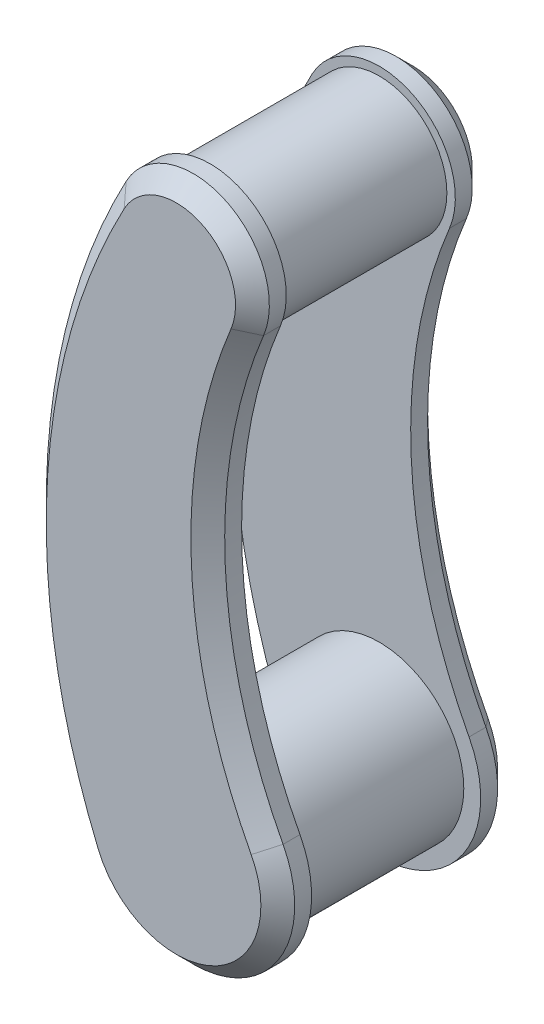
ISO-10303-21;
HEADER;
FILE_DESCRIPTION(('STEP AP214'),'2;1');
FILE_NAME('part.step','',(''),(''),'','','');
FILE_SCHEMA(('AUTOMOTIVE_DESIGN { 1 0 10303 214 1 1 1 1 }'));
ENDSEC;
DATA;
#1=APPLICATION_CONTEXT('core data for automotive mechanical design processes');
#2=APPLICATION_PROTOCOL_DEFINITION('international standard','automotive_design',2000,#1);
#3=PRODUCT_CONTEXT('',#1,'mechanical');
#4=PRODUCT('Part','Part','',(#3));
#5=PRODUCT_RELATED_PRODUCT_CATEGORY('part','',(#4));
#6=PRODUCT_DEFINITION_FORMATION('','',#4);
#7=PRODUCT_DEFINITION_CONTEXT('part definition',#1,'design');
#8=PRODUCT_DEFINITION('design','',#6,#7);
#9=PRODUCT_DEFINITION_SHAPE('','',#8);
#10=(LENGTH_UNIT() NAMED_UNIT(*) SI_UNIT(.MILLI.,.METRE.));
#11=(NAMED_UNIT(*) PLANE_ANGLE_UNIT() SI_UNIT($,.RADIAN.));
#12=(NAMED_UNIT(*) SI_UNIT($,.STERADIAN.) SOLID_ANGLE_UNIT());
#13=UNCERTAINTY_MEASURE_WITH_UNIT(LENGTH_MEASURE(1.E-05),#10,'distance_accuracy_value','');
#14=(GEOMETRIC_REPRESENTATION_CONTEXT(3) GLOBAL_UNCERTAINTY_ASSIGNED_CONTEXT((#13)) GLOBAL_UNIT_ASSIGNED_CONTEXT((#10,
#11,#12)) REPRESENTATION_CONTEXT('',''));
#15=CARTESIAN_POINT('',(0.,0.,0.));
#16=DIRECTION('',(0.,0.,1.));
#17=DIRECTION('',(1.,0.,0.));
#18=AXIS2_PLACEMENT_3D('',#15,#16,#17);
#19=CARTESIAN_POINT('',(156.53323079701,-8.68749999999996,35.));
#20=DIRECTION('',(0.,0.,-1.));
#21=DIRECTION('',(-1.,0.,0.));
#22=AXIS2_PLACEMENT_3D('',#19,#20,#21);
#23=CYLINDRICAL_SURFACE('',#22,200.);
#24=DIRECTION('',(0.,0.,-1.));
#25=VECTOR('',#24,1.);
#26=CARTESIAN_POINT('',(-27.6235113171194,-86.7022058823529,35.));
#27=LINE('',#26,#25);
#28=CARTESIAN_POINT('',(-27.6235113171194,-86.7022058823529,30.));
#29=VERTEX_POINT('',#28);
#30=CARTESIAN_POINT('',(-27.6235113171194,-86.7022058823529,25.));
#31=VERTEX_POINT('',#30);
#32=EDGE_CURVE('E213',#29,#31,#27,.T.);
#33=ORIENTED_EDGE('',*,*,#32,.F.);
#34=CARTESIAN_POINT('',(156.53323079701,-8.68749999999996,30.));
#35=DIRECTION('',(0.,0.,1.));
#36=DIRECTION('',(1.,0.,0.));
#37=AXIS2_PLACEMENT_3D('',#34,#35,#36);
#38=CIRCLE('',#37,200.);
#39=CARTESIAN_POINT('',(-19.8422405235647,85.6082746478873,30.));
#40=VERTEX_POINT('',#39);
#41=EDGE_CURVE('E227',#29,#40,#38,.F.);
#42=ORIENTED_EDGE('',*,*,#41,.T.);
#43=DIRECTION('',(0.,0.,-1.));
#44=VECTOR('',#43,1.);
#45=CARTESIAN_POINT('',(-19.8422405235647,85.6082746478873,35.));
#46=LINE('',#45,#44);
#47=CARTESIAN_POINT('',(-19.8422405235647,85.6082746478873,25.));
#48=VERTEX_POINT('',#47);
#49=EDGE_CURVE('E207',#40,#48,#46,.T.);
#50=ORIENTED_EDGE('',*,*,#49,.T.);
#51=CARTESIAN_POINT('',(156.53323079701,-8.68749999999996,25.));
#52=DIRECTION('',(0.,0.,1.));
#53=DIRECTION('',(1.,0.,0.));
#54=AXIS2_PLACEMENT_3D('',#51,#52,#53);
#55=CIRCLE('',#54,200.);
#56=EDGE_CURVE('E194',#48,#31,#55,.T.);
#57=ORIENTED_EDGE('',*,*,#56,.T.);
#58=EDGE_LOOP('',(#33,#42,#50,#57));
#59=FACE_BOUND('',#58,.T.);
#60=ADVANCED_FACE('F36',(#59),#23,.T.);
#61=CARTESIAN_POINT('',(0.,-75.,35.));
#62=DIRECTION('',(0.,0.,-1.));
#63=DIRECTION('',(-1.,0.,0.));
#64=AXIS2_PLACEMENT_3D('',#61,#62,#63);
#65=CYLINDRICAL_SURFACE('',#64,30.);
#66=DIRECTION('',(0.,0.,-1.));
#67=VECTOR('',#66,1.);
#68=CARTESIAN_POINT('',(26.549463712804,-61.0312499999999,35.));
#69=LINE('',#68,#67);
#70=CARTESIAN_POINT('',(26.549463712804,-61.0312499999999,30.));
#71=VERTEX_POINT('',#70);
#72=CARTESIAN_POINT('',(26.549463712804,-61.0312499999999,25.));
#73=VERTEX_POINT('',#72);
#74=EDGE_CURVE('E211',#71,#73,#69,.T.);
#75=ORIENTED_EDGE('',*,*,#74,.F.);
#76=CARTESIAN_POINT('',(0.,-75.,30.));
#77=DIRECTION('',(0.,0.,1.));
#78=DIRECTION('',(1.,0.,0.));
#79=AXIS2_PLACEMENT_3D('',#76,#77,#78);
#80=CIRCLE('',#79,30.);
#81=EDGE_CURVE('E59',#71,#29,#80,.F.);
#82=ORIENTED_EDGE('',*,*,#81,.T.);
#83=ORIENTED_EDGE('',*,*,#32,.T.);
#84=CARTESIAN_POINT('',(0.,-75.,25.));
#85=DIRECTION('',(0.,0.,1.));
#86=DIRECTION('',(1.,0.,0.));
#87=AXIS2_PLACEMENT_3D('',#84,#85,#86);
#88=CIRCLE('',#87,30.);
#89=EDGE_CURVE('E197',#31,#73,#88,.T.);
#90=ORIENTED_EDGE('',*,*,#89,.T.);
#91=EDGE_LOOP('',(#75,#82,#83,#90));
#92=FACE_BOUND('',#91,.T.);
#93=ADVANCED_FACE('F262',(#92),#65,.T.);
#94=CARTESIAN_POINT('',(159.296782276824,8.81250000000006,35.));
#95=DIRECTION('',(0.,0.,-1.));
#96=DIRECTION('',(-1.,0.,0.));
#97=AXIS2_PLACEMENT_3D('',#94,#95,#96);
#98=CYLINDRICAL_SURFACE('',#97,150.);
#99=DIRECTION('',(0.,0.,-1.));
#100=VECTOR('',#99,1.);
#101=CARTESIAN_POINT('',(20.7778411665423,66.366847826087,35.));
#102=LINE('',#101,#100);
#103=CARTESIAN_POINT('',(20.7778411665423,66.366847826087,30.));
#104=VERTEX_POINT('',#103);
#105=CARTESIAN_POINT('',(20.7778411665423,66.366847826087,25.));
#106=VERTEX_POINT('',#105);
#107=EDGE_CURVE('E209',#104,#106,#102,.T.);
#108=ORIENTED_EDGE('',*,*,#107,.F.);
#109=CARTESIAN_POINT('',(159.296782276824,8.81250000000006,30.));
#110=DIRECTION('',(0.,0.,1.));
#111=DIRECTION('',(1.,0.,0.));
#112=AXIS2_PLACEMENT_3D('',#109,#110,#111);
#113=CIRCLE('',#112,150.);
#114=EDGE_CURVE('E52',#104,#71,#113,.T.);
#115=ORIENTED_EDGE('',*,*,#114,.T.);
#116=ORIENTED_EDGE('',*,*,#74,.T.);
#117=CARTESIAN_POINT('',(159.296782276824,8.81250000000006,25.));
#118=DIRECTION('',(0.,0.,-1.));
#119=DIRECTION('',(1.,0.,0.));
#120=AXIS2_PLACEMENT_3D('',#117,#118,#119);
#121=CIRCLE('',#120,150.);
#122=EDGE_CURVE('E201',#73,#106,#121,.T.);
#123=ORIENTED_EDGE('',*,*,#122,.T.);
#124=EDGE_LOOP('',(#108,#115,#116,#123));
#125=FACE_BOUND('',#124,.T.);
#126=ADVANCED_FACE('F261',(#125),#98,.F.);
#127=CARTESIAN_POINT('',(0.,75.,35.));
#128=DIRECTION('',(0.,0.,-1.));
#129=DIRECTION('',(-1.,0.,0.));
#130=AXIS2_PLACEMENT_3D('',#127,#128,#129);
#131=CYLINDRICAL_SURFACE('',#130,22.5);
#132=ORIENTED_EDGE('',*,*,#49,.F.);
#133=CARTESIAN_POINT('',(0.,75.,30.));
#134=DIRECTION('',(0.,0.,1.));
#135=DIRECTION('',(1.,0.,0.));
#136=AXIS2_PLACEMENT_3D('',#133,#134,#135);
#137=CIRCLE('',#136,22.5);
#138=EDGE_CURVE('E224',#40,#104,#137,.F.);
#139=ORIENTED_EDGE('',*,*,#138,.T.);
#140=ORIENTED_EDGE('',*,*,#107,.T.);
#141=CARTESIAN_POINT('',(0.,75.,25.));
#142=DIRECTION('',(0.,0.,1.));
#143=DIRECTION('',(1.,0.,0.));
#144=AXIS2_PLACEMENT_3D('',#141,#142,#143);
#145=CIRCLE('',#144,22.5);
#146=EDGE_CURVE('E204',#106,#48,#145,.T.);
#147=ORIENTED_EDGE('',*,*,#146,.T.);
#148=EDGE_LOOP('',(#132,#139,#140,#147));
#149=FACE_BOUND('',#148,.T.);
#150=ADVANCED_FACE('F260',(#149),#131,.T.);
#151=CARTESIAN_POINT('',(78.266615398505,-41.84375,35.));
#152=DIRECTION('',(0.,0.,1.));
#153=DIRECTION('',(1.,0.,0.));
#154=AXIS2_PLACEMENT_3D('',#151,#152,#153);
#155=PLANE('',#154);
#156=CARTESIAN_POINT('',(159.296782276824,8.81250000000006,35.));
#157=DIRECTION('',(0.,0.,1.));
#158=DIRECTION('',(1.,0.,0.));
#159=AXIS2_PLACEMENT_3D('',#156,#157,#158);
#160=CIRCLE('',#159,155.);
#161=CARTESIAN_POINT('',(22.1245530940034,-63.3593749999999,35.));
#162=VERTEX_POINT('',#161);
#163=CARTESIAN_POINT('',(16.1605431295329,68.2853260869565,35.));
#164=VERTEX_POINT('',#163);
#165=EDGE_CURVE('E217',#162,#164,#160,.F.);
#166=ORIENTED_EDGE('',*,*,#165,.T.);
#167=CARTESIAN_POINT('',(0.,75.,35.));
#168=DIRECTION('',(0.,0.,1.));
#169=DIRECTION('',(1.,0.,0.));
#170=AXIS2_PLACEMENT_3D('',#167,#168,#169);
#171=CIRCLE('',#170,17.5);
#172=CARTESIAN_POINT('',(-15.4328537405503,83.2508802816901,35.));
#173=VERTEX_POINT('',#172);
#174=EDGE_CURVE('E221',#164,#173,#171,.T.);
#175=ORIENTED_EDGE('',*,*,#174,.T.);
#176=CARTESIAN_POINT('',(156.53323079701,-8.68749999999996,35.));
#177=DIRECTION('',(0.,0.,1.));
#178=DIRECTION('',(1.,0.,0.));
#179=AXIS2_PLACEMENT_3D('',#176,#177,#178);
#180=CIRCLE('',#179,195.);
#181=CARTESIAN_POINT('',(-23.0195927642662,-84.7518382352941,35.));
#182=VERTEX_POINT('',#181);
#183=EDGE_CURVE('E219',#173,#182,#180,.T.);
#184=ORIENTED_EDGE('',*,*,#183,.T.);
#185=CARTESIAN_POINT('',(0.,-75.,35.));
#186=DIRECTION('',(0.,0.,1.));
#187=DIRECTION('',(1.,0.,0.));
#188=AXIS2_PLACEMENT_3D('',#185,#186,#187);
#189=CIRCLE('',#188,25.);
#190=EDGE_CURVE('E215',#182,#162,#189,.T.);
#191=ORIENTED_EDGE('',*,*,#190,.T.);
#192=EDGE_LOOP('',(#166,#175,#184,#191));
#193=FACE_BOUND('',#192,.T.);
#194=ADVANCED_FACE('F247',(#193),#155,.T.);
#195=CARTESIAN_POINT('',(78.266615398505,-41.84375,25.));
#196=DIRECTION('',(0.,0.,1.));
#197=DIRECTION('',(1.,0.,0.));
#198=AXIS2_PLACEMENT_3D('',#195,#196,#197);
#199=PLANE('',#198);
#200=CARTESIAN_POINT('',(0.,-75.,25.));
#201=DIRECTION('',(0.,0.,1.));
#202=DIRECTION('',(1.,0.,0.));
#203=AXIS2_PLACEMENT_3D('',#200,#201,#202);
#204=CIRCLE('',#203,25.);
#205=CARTESIAN_POINT('',(25.,-75.,25.));
#206=VERTEX_POINT('',#205);
#207=EDGE_CURVE('E11',#206,#206,#204,.F.);
#208=ORIENTED_EDGE('',*,*,#207,.F.);
#209=EDGE_LOOP('',(#208));
#210=FACE_BOUND('',#209,.T.);
#211=CARTESIAN_POINT('',(0.,75.,25.));
#212=DIRECTION('',(0.,0.,1.));
#213=DIRECTION('',(1.,0.,0.));
#214=AXIS2_PLACEMENT_3D('',#211,#212,#213);
#215=CIRCLE('',#214,20.);
#216=CARTESIAN_POINT('',(20.,75.,25.));
#217=VERTEX_POINT('',#216);
#218=EDGE_CURVE('E45',#217,#217,#215,.F.);
#219=ORIENTED_EDGE('',*,*,#218,.F.);
#220=EDGE_LOOP('',(#219));
#221=FACE_BOUND('',#220,.T.);
#222=ORIENTED_EDGE('',*,*,#56,.F.);
#223=ORIENTED_EDGE('',*,*,#146,.F.);
#224=ORIENTED_EDGE('',*,*,#122,.F.);
#225=ORIENTED_EDGE('',*,*,#89,.F.);
#226=EDGE_LOOP('',(#222,#223,#224,#225));
#227=FACE_BOUND('',#226,.T.);
#228=ADVANCED_FACE('F244',(#210,#221,#227),#199,.F.);
#229=CARTESIAN_POINT('',(0.,-75.,35.));
#230=DIRECTION('',(0.,0.,-1.));
#231=DIRECTION('',(-1.,0.,0.));
#232=AXIS2_PLACEMENT_3D('',#229,#230,#231);
#233=CONICAL_SURFACE('',#232,25.,0.785398163397447);
#234=DIRECTION('',(0.651092405750615,0.27582363780843,0.707106781186548));
#235=VECTOR('',#234,1.);
#236=CARTESIAN_POINT('',(-27.6235113171194,-86.7022058823529,30.));
#237=LINE('',#236,#235);
#238=EDGE_CURVE('E234',#29,#182,#237,.T.);
#239=ORIENTED_EDGE('',*,*,#238,.F.);
#240=ORIENTED_EDGE('',*,*,#81,.F.);
#241=DIRECTION('',(0.625776860939664,0.329246594989986,-0.707106781186548));
#242=VECTOR('',#241,1.);
#243=CARTESIAN_POINT('',(22.1245530940034,-63.3593749999999,35.));
#244=LINE('',#243,#242);
#245=EDGE_CURVE('E198',#162,#71,#244,.T.);
#246=ORIENTED_EDGE('',*,*,#245,.F.);
#247=ORIENTED_EDGE('',*,*,#190,.F.);
#248=EDGE_LOOP('',(#239,#240,#246,#247));
#249=FACE_BOUND('',#248,.T.);
#250=ADVANCED_FACE('F39',(#249),#233,.T.);
#251=CARTESIAN_POINT('',(159.296782276824,8.81250000000006,35.));
#252=DIRECTION('',(0.,0.,1.));
#253=DIRECTION('',(1.,0.,0.));
#254=AXIS2_PLACEMENT_3D('',#251,#252,#253);
#255=CONICAL_SURFACE('',#254,155.,0.785398163397447);
#256=ORIENTED_EDGE('',*,*,#245,.T.);
#257=ORIENTED_EDGE('',*,*,#114,.F.);
#258=DIRECTION('',(0.652984550545735,-0.271313797563967,-0.70710678118655));
#259=VECTOR('',#258,1.);
#260=CARTESIAN_POINT('',(16.1605431295329,68.2853260869565,35.));
#261=LINE('',#260,#259);
#262=EDGE_CURVE('E232',#164,#104,#261,.T.);
#263=ORIENTED_EDGE('',*,*,#262,.F.);
#264=ORIENTED_EDGE('',*,*,#165,.F.);
#265=EDGE_LOOP('',(#256,#257,#263,#264));
#266=FACE_BOUND('',#265,.T.);
#267=ADVANCED_FACE('F286',(#266),#255,.F.);
#268=CARTESIAN_POINT('',(156.53323079701,-8.68749999999996,35.));
#269=DIRECTION('',(0.,0.,-1.));
#270=DIRECTION('',(-1.,0.,0.));
#271=AXIS2_PLACEMENT_3D('',#268,#269,#270);
#272=CONICAL_SURFACE('',#271,195.,0.785398163397447);
#273=ORIENTED_EDGE('',*,*,#238,.T.);
#274=ORIENTED_EDGE('',*,*,#183,.F.);
#275=DIRECTION('',(0.623581459028759,-0.333385908453797,0.707106781186548));
#276=VECTOR('',#275,1.);
#277=CARTESIAN_POINT('',(-19.8422405235647,85.6082746478873,30.));
#278=LINE('',#277,#276);
#279=EDGE_CURVE('E193',#40,#173,#278,.T.);
#280=ORIENTED_EDGE('',*,*,#279,.F.);
#281=ORIENTED_EDGE('',*,*,#41,.F.);
#282=EDGE_LOOP('',(#273,#274,#280,#281));
#283=FACE_BOUND('',#282,.T.);
#284=ADVANCED_FACE('F280',(#283),#272,.T.);
#285=CARTESIAN_POINT('',(0.,75.,35.));
#286=DIRECTION('',(0.,0.,-1.));
#287=DIRECTION('',(-1.,0.,0.));
#288=AXIS2_PLACEMENT_3D('',#285,#286,#287);
#289=CONICAL_SURFACE('',#288,17.5,0.785398163397448);
#290=ORIENTED_EDGE('',*,*,#262,.T.);
#291=ORIENTED_EDGE('',*,*,#138,.F.);
#292=ORIENTED_EDGE('',*,*,#279,.T.);
#293=ORIENTED_EDGE('',*,*,#174,.F.);
#294=EDGE_LOOP('',(#290,#291,#292,#293));
#295=FACE_BOUND('',#294,.T.);
#296=ADVANCED_FACE('F274',(#295),#289,.T.);
#297=CARTESIAN_POINT('',(0.,75.,-5.));
#298=DIRECTION('',(0.,0.,1.));
#299=DIRECTION('',(1.,0.,0.));
#300=AXIS2_PLACEMENT_3D('',#297,#298,#299);
#301=CYLINDRICAL_SURFACE('',#300,20.);
#302=ORIENTED_EDGE('',*,*,#218,.T.);
#303=EDGE_LOOP('',(#302));
#304=FACE_BOUND('',#303,.T.);
#305=CARTESIAN_POINT('',(0.,75.,-25.));
#306=DIRECTION('',(0.,0.,1.));
#307=DIRECTION('',(1.,0.,0.));
#308=AXIS2_PLACEMENT_3D('',#305,#306,#307);
#309=CIRCLE('',#308,20.);
#310=CARTESIAN_POINT('',(20.,75.,-25.));
#311=VERTEX_POINT('',#310);
#312=EDGE_CURVE('E180',#311,#311,#309,.F.);
#313=ORIENTED_EDGE('',*,*,#312,.F.);
#314=EDGE_LOOP('',(#313));
#315=FACE_BOUND('',#314,.T.);
#316=ADVANCED_FACE('F241',(#304,#315),#301,.T.);
#317=CARTESIAN_POINT('',(0.,-75.,-5.));
#318=DIRECTION('',(0.,0.,1.));
#319=DIRECTION('',(1.,0.,0.));
#320=AXIS2_PLACEMENT_3D('',#317,#318,#319);
#321=CYLINDRICAL_SURFACE('',#320,25.);
#322=ORIENTED_EDGE('',*,*,#207,.T.);
#323=EDGE_LOOP('',(#322));
#324=FACE_BOUND('',#323,.T.);
#325=CARTESIAN_POINT('',(0.,-75.,-25.));
#326=DIRECTION('',(0.,0.,1.));
#327=DIRECTION('',(1.,0.,0.));
#328=AXIS2_PLACEMENT_3D('',#325,#326,#327);
#329=CIRCLE('',#328,25.);
#330=CARTESIAN_POINT('',(25.,-75.,-25.));
#331=VERTEX_POINT('',#330);
#332=EDGE_CURVE('E190',#331,#331,#329,.F.);
#333=ORIENTED_EDGE('',*,*,#332,.F.);
#334=EDGE_LOOP('',(#333));
#335=FACE_BOUND('',#334,.T.);
#336=ADVANCED_FACE('F312',(#324,#335),#321,.T.);
#337=CARTESIAN_POINT('',(156.53323079701,-8.68749999999996,-35.));
#338=DIRECTION('',(0.,0.,1.));
#339=DIRECTION('',(-1.,0.,0.));
#340=AXIS2_PLACEMENT_3D('',#337,#338,#339);
#341=CYLINDRICAL_SURFACE('',#340,200.);
#342=DIRECTION('',(0.,0.,1.));
#343=VECTOR('',#342,1.);
#344=CARTESIAN_POINT('',(-27.6235113171194,-86.7022058823529,-35.));
#345=LINE('',#344,#343);
#346=CARTESIAN_POINT('',(-27.6235113171194,-86.7022058823529,-30.));
#347=VERTEX_POINT('',#346);
#348=CARTESIAN_POINT('',(-27.6235113171194,-86.7022058823529,-25.));
#349=VERTEX_POINT('',#348);
#350=EDGE_CURVE('E133',#347,#349,#345,.T.);
#351=ORIENTED_EDGE('',*,*,#350,.T.);
#352=CARTESIAN_POINT('',(156.53323079701,-8.68749999999996,-25.));
#353=DIRECTION('',(0.,0.,1.));
#354=DIRECTION('',(1.,0.,0.));
#355=AXIS2_PLACEMENT_3D('',#352,#353,#354);
#356=CIRCLE('',#355,200.);
#357=CARTESIAN_POINT('',(-19.8422405235647,85.6082746478873,-25.));
#358=VERTEX_POINT('',#357);
#359=EDGE_CURVE('E139',#358,#349,#356,.T.);
#360=ORIENTED_EDGE('',*,*,#359,.F.);
#361=DIRECTION('',(0.,0.,1.));
#362=VECTOR('',#361,1.);
#363=CARTESIAN_POINT('',(-19.8422405235647,85.6082746478873,-35.));
#364=LINE('',#363,#362);
#365=CARTESIAN_POINT('',(-19.8422405235647,85.6082746478873,-30.));
#366=VERTEX_POINT('',#365);
#367=EDGE_CURVE('E360',#366,#358,#364,.T.);
#368=ORIENTED_EDGE('',*,*,#367,.F.);
#369=CARTESIAN_POINT('',(156.53323079701,-8.68749999999996,-30.));
#370=DIRECTION('',(0.,0.,1.));
#371=DIRECTION('',(1.,0.,0.));
#372=AXIS2_PLACEMENT_3D('',#369,#370,#371);
#373=CIRCLE('',#372,200.);
#374=EDGE_CURVE('E152',#347,#366,#373,.F.);
#375=ORIENTED_EDGE('',*,*,#374,.F.);
#376=EDGE_LOOP('',(#351,#360,#368,#375));
#377=FACE_BOUND('',#376,.T.);
#378=ADVANCED_FACE('F150',(#377),#341,.T.);
#379=CARTESIAN_POINT('',(0.,-75.,-35.));
#380=DIRECTION('',(0.,0.,1.));
#381=DIRECTION('',(-1.,0.,0.));
#382=AXIS2_PLACEMENT_3D('',#379,#380,#381);
#383=CYLINDRICAL_SURFACE('',#382,30.);
#384=DIRECTION('',(0.,0.,1.));
#385=VECTOR('',#384,1.);
#386=CARTESIAN_POINT('',(26.549463712804,-61.0312499999999,-35.));
#387=LINE('',#386,#385);
#388=CARTESIAN_POINT('',(26.549463712804,-61.0312499999999,-30.));
#389=VERTEX_POINT('',#388);
#390=CARTESIAN_POINT('',(26.549463712804,-61.0312499999999,-25.));
#391=VERTEX_POINT('',#390);
#392=EDGE_CURVE('E135',#389,#391,#387,.T.);
#393=ORIENTED_EDGE('',*,*,#392,.T.);
#394=CARTESIAN_POINT('',(0.,-75.,-25.));
#395=DIRECTION('',(0.,0.,1.));
#396=DIRECTION('',(1.,0.,0.));
#397=AXIS2_PLACEMENT_3D('',#394,#395,#396);
#398=CIRCLE('',#397,30.);
#399=EDGE_CURVE('E128',#349,#391,#398,.T.);
#400=ORIENTED_EDGE('',*,*,#399,.F.);
#401=ORIENTED_EDGE('',*,*,#350,.F.);
#402=CARTESIAN_POINT('',(0.,-75.,-30.));
#403=DIRECTION('',(0.,0.,1.));
#404=DIRECTION('',(1.,0.,0.));
#405=AXIS2_PLACEMENT_3D('',#402,#403,#404);
#406=CIRCLE('',#405,30.);
#407=EDGE_CURVE('E177',#389,#347,#406,.F.);
#408=ORIENTED_EDGE('',*,*,#407,.F.);
#409=EDGE_LOOP('',(#393,#400,#401,#408));
#410=FACE_BOUND('',#409,.T.);
#411=ADVANCED_FACE('F130',(#410),#383,.T.);
#412=CARTESIAN_POINT('',(159.296782276824,8.81250000000006,-35.));
#413=DIRECTION('',(0.,0.,1.));
#414=DIRECTION('',(-1.,0.,0.));
#415=AXIS2_PLACEMENT_3D('',#412,#413,#414);
#416=CYLINDRICAL_SURFACE('',#415,150.);
#417=DIRECTION('',(0.,0.,1.));
#418=VECTOR('',#417,1.);
#419=CARTESIAN_POINT('',(20.7778411665423,66.366847826087,-35.));
#420=LINE('',#419,#418);
#421=CARTESIAN_POINT('',(20.7778411665423,66.366847826087,-30.));
#422=VERTEX_POINT('',#421);
#423=CARTESIAN_POINT('',(20.7778411665423,66.366847826087,-25.));
#424=VERTEX_POINT('',#423);
#425=EDGE_CURVE('E158',#422,#424,#420,.T.);
#426=ORIENTED_EDGE('',*,*,#425,.T.);
#427=CARTESIAN_POINT('',(159.296782276824,8.81250000000006,-25.));
#428=DIRECTION('',(0.,0.,-1.));
#429=DIRECTION('',(1.,0.,0.));
#430=AXIS2_PLACEMENT_3D('',#427,#428,#429);
#431=CIRCLE('',#430,150.);
#432=EDGE_CURVE('E138',#391,#424,#431,.T.);
#433=ORIENTED_EDGE('',*,*,#432,.F.);
#434=ORIENTED_EDGE('',*,*,#392,.F.);
#435=CARTESIAN_POINT('',(159.296782276824,8.81250000000006,-30.));
#436=DIRECTION('',(0.,0.,1.));
#437=DIRECTION('',(1.,0.,0.));
#438=AXIS2_PLACEMENT_3D('',#435,#436,#437);
#439=CIRCLE('',#438,150.);
#440=EDGE_CURVE('E174',#422,#389,#439,.T.);
#441=ORIENTED_EDGE('',*,*,#440,.F.);
#442=EDGE_LOOP('',(#426,#433,#434,#441));
#443=FACE_BOUND('',#442,.T.);
#444=ADVANCED_FACE('F336',(#443),#416,.F.);
#445=CARTESIAN_POINT('',(0.,75.,-35.));
#446=DIRECTION('',(0.,0.,1.));
#447=DIRECTION('',(-1.,0.,0.));
#448=AXIS2_PLACEMENT_3D('',#445,#446,#447);
#449=CYLINDRICAL_SURFACE('',#448,22.5);
#450=ORIENTED_EDGE('',*,*,#367,.T.);
#451=CARTESIAN_POINT('',(0.,75.,-25.));
#452=DIRECTION('',(0.,0.,1.));
#453=DIRECTION('',(1.,0.,0.));
#454=AXIS2_PLACEMENT_3D('',#451,#452,#453);
#455=CIRCLE('',#454,22.5);
#456=EDGE_CURVE('E143',#424,#358,#455,.T.);
#457=ORIENTED_EDGE('',*,*,#456,.F.);
#458=ORIENTED_EDGE('',*,*,#425,.F.);
#459=CARTESIAN_POINT('',(0.,75.,-30.));
#460=DIRECTION('',(0.,0.,1.));
#461=DIRECTION('',(1.,0.,0.));
#462=AXIS2_PLACEMENT_3D('',#459,#460,#461);
#463=CIRCLE('',#462,22.5);
#464=EDGE_CURVE('E170',#366,#422,#463,.F.);
#465=ORIENTED_EDGE('',*,*,#464,.F.);
#466=EDGE_LOOP('',(#450,#457,#458,#465));
#467=FACE_BOUND('',#466,.T.);
#468=ADVANCED_FACE('F339',(#467),#449,.T.);
#469=CARTESIAN_POINT('',(78.266615398505,-41.84375,-35.));
#470=DIRECTION('',(0.,0.,-1.));
#471=DIRECTION('',(1.,0.,0.));
#472=AXIS2_PLACEMENT_3D('',#469,#470,#471);
#473=PLANE('',#472);
#474=CARTESIAN_POINT('',(159.296782276824,8.81250000000006,-35.));
#475=DIRECTION('',(0.,0.,1.));
#476=DIRECTION('',(1.,0.,0.));
#477=AXIS2_PLACEMENT_3D('',#474,#475,#476);
#478=CIRCLE('',#477,155.);
#479=CARTESIAN_POINT('',(22.1245530940034,-63.3593749999999,-35.));
#480=VERTEX_POINT('',#479);
#481=CARTESIAN_POINT('',(16.1605431295329,68.2853260869565,-35.));
#482=VERTEX_POINT('',#481);
#483=EDGE_CURVE('E156',#480,#482,#478,.F.);
#484=ORIENTED_EDGE('',*,*,#483,.F.);
#485=CARTESIAN_POINT('',(0.,-75.,-35.));
#486=DIRECTION('',(0.,0.,1.));
#487=DIRECTION('',(1.,0.,0.));
#488=AXIS2_PLACEMENT_3D('',#485,#486,#487);
#489=CIRCLE('',#488,25.);
#490=CARTESIAN_POINT('',(-23.0195927642662,-84.7518382352941,-35.));
#491=VERTEX_POINT('',#490);
#492=EDGE_CURVE('E153',#491,#480,#489,.T.);
#493=ORIENTED_EDGE('',*,*,#492,.F.);
#494=CARTESIAN_POINT('',(156.53323079701,-8.68749999999996,-35.));
#495=DIRECTION('',(0.,0.,1.));
#496=DIRECTION('',(1.,0.,0.));
#497=AXIS2_PLACEMENT_3D('',#494,#495,#496);
#498=CIRCLE('',#497,195.);
#499=CARTESIAN_POINT('',(-15.4328537405503,83.2508802816901,-35.));
#500=VERTEX_POINT('',#499);
#501=EDGE_CURVE('E164',#500,#491,#498,.T.);
#502=ORIENTED_EDGE('',*,*,#501,.F.);
#503=CARTESIAN_POINT('',(0.,75.,-35.));
#504=DIRECTION('',(0.,0.,1.));
#505=DIRECTION('',(1.,0.,0.));
#506=AXIS2_PLACEMENT_3D('',#503,#504,#505);
#507=CIRCLE('',#506,17.5);
#508=EDGE_CURVE('E167',#482,#500,#507,.T.);
#509=ORIENTED_EDGE('',*,*,#508,.F.);
#510=EDGE_LOOP('',(#484,#493,#502,#509));
#511=FACE_BOUND('',#510,.T.);
#512=ADVANCED_FACE('F343',(#511),#473,.T.);
#513=CARTESIAN_POINT('',(78.266615398505,-41.84375,-25.));
#514=DIRECTION('',(0.,0.,-1.));
#515=DIRECTION('',(1.,0.,0.));
#516=AXIS2_PLACEMENT_3D('',#513,#514,#515);
#517=PLANE('',#516);
#518=ORIENTED_EDGE('',*,*,#332,.T.);
#519=EDGE_LOOP('',(#518));
#520=FACE_BOUND('',#519,.T.);
#521=ORIENTED_EDGE('',*,*,#312,.T.);
#522=EDGE_LOOP('',(#521));
#523=FACE_BOUND('',#522,.T.);
#524=ORIENTED_EDGE('',*,*,#359,.T.);
#525=ORIENTED_EDGE('',*,*,#399,.T.);
#526=ORIENTED_EDGE('',*,*,#432,.T.);
#527=ORIENTED_EDGE('',*,*,#456,.T.);
#528=EDGE_LOOP('',(#524,#525,#526,#527));
#529=FACE_BOUND('',#528,.T.);
#530=ADVANCED_FACE('F142',(#520,#523,#529),#517,.F.);
#531=CARTESIAN_POINT('',(0.,-75.,-35.));
#532=DIRECTION('',(0.,0.,1.));
#533=DIRECTION('',(-1.,0.,0.));
#534=AXIS2_PLACEMENT_3D('',#531,#532,#533);
#535=CONICAL_SURFACE('',#534,25.,0.785398163397447);
#536=DIRECTION('',(0.651092405750615,0.27582363780843,-0.707106781186548));
#537=VECTOR('',#536,1.);
#538=CARTESIAN_POINT('',(-27.6235113171194,-86.7022058823529,-30.));
#539=LINE('',#538,#537);
#540=EDGE_CURVE('E185',#347,#491,#539,.T.);
#541=ORIENTED_EDGE('',*,*,#540,.T.);
#542=ORIENTED_EDGE('',*,*,#492,.T.);
#543=DIRECTION('',(0.625776860939664,0.329246594989986,0.707106781186548));
#544=VECTOR('',#543,1.);
#545=CARTESIAN_POINT('',(22.1245530940034,-63.3593749999999,-35.));
#546=LINE('',#545,#544);
#547=EDGE_CURVE('E147',#480,#389,#546,.T.);
#548=ORIENTED_EDGE('',*,*,#547,.T.);
#549=ORIENTED_EDGE('',*,*,#407,.T.);
#550=EDGE_LOOP('',(#541,#542,#548,#549));
#551=FACE_BOUND('',#550,.T.);
#552=ADVANCED_FACE('F316',(#551),#535,.T.);
#553=CARTESIAN_POINT('',(159.296782276824,8.81250000000006,-35.));
#554=DIRECTION('',(0.,0.,-1.));
#555=DIRECTION('',(1.,0.,0.));
#556=AXIS2_PLACEMENT_3D('',#553,#554,#555);
#557=CONICAL_SURFACE('',#556,155.,0.785398163397447);
#558=ORIENTED_EDGE('',*,*,#547,.F.);
#559=ORIENTED_EDGE('',*,*,#483,.T.);
#560=DIRECTION('',(0.652984550545735,-0.271313797563967,0.70710678118655));
#561=VECTOR('',#560,1.);
#562=CARTESIAN_POINT('',(16.1605431295329,68.2853260869565,-35.));
#563=LINE('',#562,#561);
#564=EDGE_CURVE('E183',#482,#422,#563,.T.);
#565=ORIENTED_EDGE('',*,*,#564,.T.);
#566=ORIENTED_EDGE('',*,*,#440,.T.);
#567=EDGE_LOOP('',(#558,#559,#565,#566));
#568=FACE_BOUND('',#567,.T.);
#569=ADVANCED_FACE('F319',(#568),#557,.F.);
#570=CARTESIAN_POINT('',(156.53323079701,-8.68749999999996,-35.));
#571=DIRECTION('',(0.,0.,1.));
#572=DIRECTION('',(-1.,0.,0.));
#573=AXIS2_PLACEMENT_3D('',#570,#571,#572);
#574=CONICAL_SURFACE('',#573,195.,0.785398163397447);
#575=ORIENTED_EDGE('',*,*,#540,.F.);
#576=ORIENTED_EDGE('',*,*,#374,.T.);
#577=DIRECTION('',(0.623581459028759,-0.333385908453797,-0.707106781186548));
#578=VECTOR('',#577,1.);
#579=CARTESIAN_POINT('',(-19.8422405235647,85.6082746478873,-30.));
#580=LINE('',#579,#578);
#581=EDGE_CURVE('E181',#366,#500,#580,.T.);
#582=ORIENTED_EDGE('',*,*,#581,.T.);
#583=ORIENTED_EDGE('',*,*,#501,.T.);
#584=EDGE_LOOP('',(#575,#576,#582,#583));
#585=FACE_BOUND('',#584,.T.);
#586=ADVANCED_FACE('F323',(#585),#574,.T.);
#587=CARTESIAN_POINT('',(0.,75.,-35.));
#588=DIRECTION('',(0.,0.,1.));
#589=DIRECTION('',(-1.,0.,0.));
#590=AXIS2_PLACEMENT_3D('',#587,#588,#589);
#591=CONICAL_SURFACE('',#590,17.5,0.785398163397448);
#592=ORIENTED_EDGE('',*,*,#564,.F.);
#593=ORIENTED_EDGE('',*,*,#508,.T.);
#594=ORIENTED_EDGE('',*,*,#581,.F.);
#595=ORIENTED_EDGE('',*,*,#464,.T.);
#596=EDGE_LOOP('',(#592,#593,#594,#595));
#597=FACE_BOUND('',#596,.T.);
#598=ADVANCED_FACE('F327',(#597),#591,.T.);
#599=CLOSED_SHELL('',(#60,#93,#126,#150,#194,#228,#250,#267,#284,#296,#316,#336,#378,#411,#444,
#468,#512,#530,#552,#569,#586,#598));
#600=MANIFOLD_SOLID_BREP('B2',#599);
#601=ADVANCED_BREP_SHAPE_REPRESENTATION('',(#18,#600),#14);
#602=SHAPE_DEFINITION_REPRESENTATION(#9,#601);
ENDSEC;
END-ISO-10303-21;
